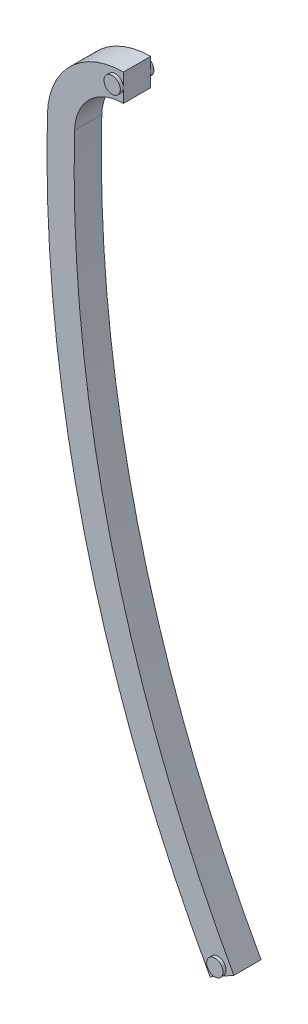
ISO-10303-21;
HEADER;
FILE_DESCRIPTION(('STEP AP214'),'2;1');
FILE_NAME('part.step','',(''),(''),'','','');
FILE_SCHEMA(('AUTOMOTIVE_DESIGN { 1 0 10303 214 1 1 1 1 }'));
ENDSEC;
DATA;
#1=APPLICATION_CONTEXT('core data for automotive mechanical design processes');
#2=APPLICATION_PROTOCOL_DEFINITION('international standard','automotive_design',2000,#1);
#3=PRODUCT_CONTEXT('',#1,'mechanical');
#4=PRODUCT('Part','Part','',(#3));
#5=PRODUCT_RELATED_PRODUCT_CATEGORY('part','',(#4));
#6=PRODUCT_DEFINITION_FORMATION('','',#4);
#7=PRODUCT_DEFINITION_CONTEXT('part definition',#1,'design');
#8=PRODUCT_DEFINITION('design','',#6,#7);
#9=PRODUCT_DEFINITION_SHAPE('','',#8);
#10=(LENGTH_UNIT() NAMED_UNIT(*) SI_UNIT(.MILLI.,.METRE.));
#11=(NAMED_UNIT(*) PLANE_ANGLE_UNIT() SI_UNIT($,.RADIAN.));
#12=(NAMED_UNIT(*) SI_UNIT($,.STERADIAN.) SOLID_ANGLE_UNIT());
#13=UNCERTAINTY_MEASURE_WITH_UNIT(LENGTH_MEASURE(1.E-05),#10,'distance_accuracy_value','');
#14=(GEOMETRIC_REPRESENTATION_CONTEXT(3) GLOBAL_UNCERTAINTY_ASSIGNED_CONTEXT((#13)) GLOBAL_UNIT_ASSIGNED_CONTEXT((#10,
#11,#12)) REPRESENTATION_CONTEXT('',''));
#15=CARTESIAN_POINT('',(0.,0.,0.));
#16=DIRECTION('',(0.,0.,1.));
#17=DIRECTION('',(1.,0.,0.));
#18=AXIS2_PLACEMENT_3D('',#15,#16,#17);
#19=CARTESIAN_POINT('',(-143.459415834383,3.81000110990592,3.175));
#20=DIRECTION('',(0.,0.,-1.));
#21=DIRECTION('',(-1.,0.,0.));
#22=AXIS2_PLACEMENT_3D('',#19,#20,#21);
#23=CYLINDRICAL_SURFACE('',#22,8.89);
#24=CARTESIAN_POINT('',(-143.459415834383,3.81000110990592,0.));
#25=DIRECTION('',(0.,0.,1.));
#26=DIRECTION('',(1.,0.,0.));
#27=AXIS2_PLACEMENT_3D('',#24,#25,#26);
#28=CIRCLE('',#27,8.89);
#29=CARTESIAN_POINT('',(-152.346282302,4.0460188777762,0.));
#30=VERTEX_POINT('',#29);
#31=CARTESIAN_POINT('',(-143.459415834383,12.7000011099059,0.));
#32=VERTEX_POINT('',#31);
#33=EDGE_CURVE('E119',#30,#32,#28,.F.);
#34=ORIENTED_EDGE('',*,*,#33,.F.);
#35=DIRECTION('',(0.,0.,-1.));
#36=VECTOR('',#35,1.);
#37=CARTESIAN_POINT('',(-152.346282302,4.0460188777762,3.175));
#38=LINE('',#37,#36);
#39=CARTESIAN_POINT('',(-152.346282302,4.0460188777762,3.175));
#40=VERTEX_POINT('',#39);
#41=EDGE_CURVE('E142',#40,#30,#38,.T.);
#42=ORIENTED_EDGE('',*,*,#41,.F.);
#43=CARTESIAN_POINT('',(-143.459415834383,3.81000110990592,3.175));
#44=DIRECTION('',(0.,0.,1.));
#45=DIRECTION('',(1.,0.,0.));
#46=AXIS2_PLACEMENT_3D('',#43,#44,#45);
#47=CIRCLE('',#46,8.89);
#48=CARTESIAN_POINT('',(-143.459415834383,12.7000011099059,3.175));
#49=VERTEX_POINT('',#48);
#50=EDGE_CURVE('E129',#40,#49,#47,.F.);
#51=ORIENTED_EDGE('',*,*,#50,.T.);
#52=DIRECTION('',(0.,0.,-1.));
#53=VECTOR('',#52,1.);
#54=CARTESIAN_POINT('',(-143.459415834383,12.7000011099059,3.175));
#55=LINE('',#54,#53);
#56=EDGE_CURVE('E130',#49,#32,#55,.T.);
#57=ORIENTED_EDGE('',*,*,#56,.T.);
#58=EDGE_LOOP('',(#34,#42,#51,#57));
#59=FACE_BOUND('',#58,.T.);
#60=ADVANCED_FACE('F40',(#59),#23,.T.);
#61=CARTESIAN_POINT('',(0.,0.,3.175));
#62=DIRECTION('',(0.,0.,-1.));
#63=DIRECTION('',(-1.,0.,0.));
#64=AXIS2_PLACEMENT_3D('',#61,#62,#63);
#65=CYLINDRICAL_SURFACE('',#64,152.4);
#66=CARTESIAN_POINT('',(0.,0.,0.));
#67=DIRECTION('',(0.,0.,1.));
#68=DIRECTION('',(1.,0.,0.));
#69=AXIS2_PLACEMENT_3D('',#66,#67,#68);
#70=CIRCLE('',#69,152.4);
#71=CARTESIAN_POINT('',(-133.350000582623,-73.7803316922238,0.));
#72=VERTEX_POINT('',#71);
#73=EDGE_CURVE('E118',#30,#72,#70,.T.);
#74=ORIENTED_EDGE('',*,*,#73,.T.);
#75=DIRECTION('',(0.,0.,-1.));
#76=VECTOR('',#75,1.);
#77=CARTESIAN_POINT('',(-133.350000582623,-73.7803316922238,3.175));
#78=LINE('',#77,#76);
#79=CARTESIAN_POINT('',(-133.350000582623,-73.7803316922238,3.175));
#80=VERTEX_POINT('',#79);
#81=EDGE_CURVE('E115',#80,#72,#78,.T.);
#82=ORIENTED_EDGE('',*,*,#81,.F.);
#83=CARTESIAN_POINT('',(0.,0.,3.175));
#84=DIRECTION('',(0.,0.,1.));
#85=DIRECTION('',(1.,0.,0.));
#86=AXIS2_PLACEMENT_3D('',#83,#84,#85);
#87=CIRCLE('',#86,152.4);
#88=EDGE_CURVE('E161',#40,#80,#87,.T.);
#89=ORIENTED_EDGE('',*,*,#88,.F.);
#90=ORIENTED_EDGE('',*,*,#41,.T.);
#91=EDGE_LOOP('',(#74,#82,#89,#90));
#92=FACE_BOUND('',#91,.T.);
#93=ADVANCED_FACE('F211',(#92),#65,.T.);
#94=CARTESIAN_POINT('',(2.41867981326341E-13,-4.3715031785612E-13,3.175));
#95=DIRECTION('',(0.484122911366295,-0.875000003822984,0.));
#96=DIRECTION('',(0.875000003822984,0.484122911366295,0.));
#97=AXIS2_PLACEMENT_3D('',#94,#95,#96);
#98=PLANE('',#97);
#99=DIRECTION('',(-0.875000003822984,-0.484122911366295,0.));
#100=VECTOR('',#99,1.);
#101=CARTESIAN_POINT('',(2.41867981326341E-13,-4.3715031785612E-13,0.));
#102=LINE('',#101,#100);
#103=CARTESIAN_POINT('',(-131.960938076554,-73.0117865704298,0.));
#104=VERTEX_POINT('',#103);
#105=EDGE_CURVE('E110',#104,#72,#102,.T.);
#106=ORIENTED_EDGE('',*,*,#105,.F.);
#107=CARTESIAN_POINT('',(-130.571875570485,-72.2432414486358,0.));
#108=VERTEX_POINT('',#107);
#109=EDGE_CURVE('E103',#108,#104,#102,.T.);
#110=ORIENTED_EDGE('',*,*,#109,.F.);
#111=DIRECTION('',(0.,0.,-1.));
#112=VECTOR('',#111,1.);
#113=CARTESIAN_POINT('',(-130.571875570485,-72.2432414486358,3.175));
#114=LINE('',#113,#112);
#115=CARTESIAN_POINT('',(-130.571875570485,-72.2432414486358,3.175));
#116=VERTEX_POINT('',#115);
#117=EDGE_CURVE('E139',#116,#108,#114,.T.);
#118=ORIENTED_EDGE('',*,*,#117,.F.);
#119=DIRECTION('',(-0.875000003822984,-0.484122911366295,0.));
#120=VECTOR('',#119,1.);
#121=CARTESIAN_POINT('',(2.41867981326341E-13,-4.3715031785612E-13,3.175));
#122=LINE('',#121,#120);
#123=CARTESIAN_POINT('',(-131.960938076554,-73.0117865704298,3.175));
#124=VERTEX_POINT('',#123);
#125=EDGE_CURVE('E168',#116,#124,#122,.T.);
#126=ORIENTED_EDGE('',*,*,#125,.T.);
#127=EDGE_CURVE('E163',#124,#80,#122,.T.);
#128=ORIENTED_EDGE('',*,*,#127,.T.);
#129=ORIENTED_EDGE('',*,*,#81,.T.);
#130=EDGE_LOOP('',(#106,#110,#118,#126,#128,#129));
#131=FACE_BOUND('',#130,.T.);
#132=ADVANCED_FACE('F113',(#131),#98,.T.);
#133=CARTESIAN_POINT('',(0.,0.,3.175));
#134=DIRECTION('',(0.,0.,-1.));
#135=DIRECTION('',(-1.,0.,0.));
#136=AXIS2_PLACEMENT_3D('',#133,#134,#135);
#137=CYLINDRICAL_SURFACE('',#136,149.225);
#138=CARTESIAN_POINT('',(0.,0.,0.));
#139=DIRECTION('',(0.,0.,1.));
#140=DIRECTION('',(1.,0.,0.));
#141=AXIS2_PLACEMENT_3D('',#138,#139,#140);
#142=CIRCLE('',#141,149.225);
#143=CARTESIAN_POINT('',(-149.172401420708,3.96172681782252,0.));
#144=VERTEX_POINT('',#143);
#145=EDGE_CURVE('E108',#144,#108,#142,.T.);
#146=ORIENTED_EDGE('',*,*,#145,.F.);
#147=DIRECTION('',(0.,0.,-1.));
#148=VECTOR('',#147,1.);
#149=CARTESIAN_POINT('',(-149.172401420708,3.96172681782252,3.175));
#150=LINE('',#149,#148);
#151=CARTESIAN_POINT('',(-149.172401420708,3.96172681782252,3.175));
#152=VERTEX_POINT('',#151);
#153=EDGE_CURVE('E137',#152,#144,#150,.T.);
#154=ORIENTED_EDGE('',*,*,#153,.F.);
#155=CARTESIAN_POINT('',(0.,0.,3.175));
#156=DIRECTION('',(0.,0.,1.));
#157=DIRECTION('',(1.,0.,0.));
#158=AXIS2_PLACEMENT_3D('',#155,#156,#157);
#159=CIRCLE('',#158,149.225);
#160=EDGE_CURVE('E171',#152,#116,#159,.T.);
#161=ORIENTED_EDGE('',*,*,#160,.T.);
#162=ORIENTED_EDGE('',*,*,#117,.T.);
#163=EDGE_LOOP('',(#146,#154,#161,#162));
#164=FACE_BOUND('',#163,.T.);
#165=ADVANCED_FACE('F219',(#164),#137,.F.);
#166=CARTESIAN_POINT('',(-143.459415834383,3.81000110990592,3.175));
#167=DIRECTION('',(0.,0.,-1.));
#168=DIRECTION('',(-1.,0.,0.));
#169=AXIS2_PLACEMENT_3D('',#166,#167,#168);
#170=CYLINDRICAL_SURFACE('',#169,5.71499999999999);
#171=CARTESIAN_POINT('',(-143.459415834383,3.81000110990592,0.));
#172=DIRECTION('',(0.,0.,1.));
#173=DIRECTION('',(1.,0.,0.));
#174=AXIS2_PLACEMENT_3D('',#171,#172,#173);
#175=CIRCLE('',#174,5.71499999999999);
#176=CARTESIAN_POINT('',(-143.459415834383,9.52500110990591,0.));
#177=VERTEX_POINT('',#176);
#178=EDGE_CURVE('E124',#144,#177,#175,.F.);
#179=ORIENTED_EDGE('',*,*,#178,.T.);
#180=DIRECTION('',(0.,0.,-1.));
#181=VECTOR('',#180,1.);
#182=CARTESIAN_POINT('',(-143.459415834383,9.52500110990591,3.175));
#183=LINE('',#182,#181);
#184=CARTESIAN_POINT('',(-143.459415834383,9.52500110990591,3.175));
#185=VERTEX_POINT('',#184);
#186=EDGE_CURVE('E133',#185,#177,#183,.T.);
#187=ORIENTED_EDGE('',*,*,#186,.F.);
#188=CARTESIAN_POINT('',(-143.459415834383,3.81000110990592,3.175));
#189=DIRECTION('',(0.,0.,1.));
#190=DIRECTION('',(1.,0.,0.));
#191=AXIS2_PLACEMENT_3D('',#188,#189,#190);
#192=CIRCLE('',#191,5.71499999999999);
#193=EDGE_CURVE('E174',#152,#185,#192,.F.);
#194=ORIENTED_EDGE('',*,*,#193,.F.);
#195=ORIENTED_EDGE('',*,*,#153,.T.);
#196=EDGE_LOOP('',(#179,#187,#194,#195));
#197=FACE_BOUND('',#196,.T.);
#198=ADVANCED_FACE('F224',(#197),#170,.F.);
#199=CARTESIAN_POINT('',(-143.459415834383,-1.2541098154221E-12,3.175));
#200=DIRECTION('',(-1.,0.,0.));
#201=DIRECTION('',(0.,-1.,0.));
#202=AXIS2_PLACEMENT_3D('',#199,#200,#201);
#203=PLANE('',#202);
#204=DIRECTION('',(0.,1.,0.));
#205=VECTOR('',#204,1.);
#206=CARTESIAN_POINT('',(-143.459415834383,-1.2541098154221E-12,3.175));
#207=LINE('',#206,#205);
#208=CARTESIAN_POINT('',(-143.459415834383,11.1125011099059,3.175));
#209=VERTEX_POINT('',#208);
#210=EDGE_CURVE('E176',#209,#49,#207,.T.);
#211=ORIENTED_EDGE('',*,*,#210,.F.);
#212=EDGE_CURVE('E134',#185,#209,#207,.T.);
#213=ORIENTED_EDGE('',*,*,#212,.F.);
#214=ORIENTED_EDGE('',*,*,#186,.T.);
#215=DIRECTION('',(0.,1.,0.));
#216=VECTOR('',#215,1.);
#217=CARTESIAN_POINT('',(-143.459415834383,-1.2541098154221E-12,0.));
#218=LINE('',#217,#216);
#219=CARTESIAN_POINT('',(-143.459415834383,11.1125011099059,0.));
#220=VERTEX_POINT('',#219);
#221=EDGE_CURVE('E127',#177,#220,#218,.T.);
#222=ORIENTED_EDGE('',*,*,#221,.T.);
#223=EDGE_CURVE('E126',#220,#32,#218,.T.);
#224=ORIENTED_EDGE('',*,*,#223,.T.);
#225=ORIENTED_EDGE('',*,*,#56,.F.);
#226=EDGE_LOOP('',(#211,#213,#214,#222,#224,#225));
#227=FACE_BOUND('',#226,.T.);
#228=ADVANCED_FACE('F154',(#227),#203,.F.);
#229=CARTESIAN_POINT('',(0.,0.,3.175));
#230=DIRECTION('',(0.,0.,1.));
#231=DIRECTION('',(1.,0.,0.));
#232=AXIS2_PLACEMENT_3D('',#229,#230,#231);
#233=PLANE('',#232);
#234=ORIENTED_EDGE('',*,*,#127,.F.);
#235=CARTESIAN_POINT('',(-132.42206514963,-72.1783490667884,3.175));
#236=DIRECTION('',(0.,0.,1.));
#237=DIRECTION('',(1.,0.,0.));
#238=AXIS2_PLACEMENT_3D('',#235,#236,#237);
#239=CIRCLE('',#238,0.952499999999996);
#240=EDGE_CURVE('E52',#124,#124,#239,.F.);
#241=ORIENTED_EDGE('',*,*,#240,.T.);
#242=ORIENTED_EDGE('',*,*,#125,.F.);
#243=ORIENTED_EDGE('',*,*,#160,.F.);
#244=ORIENTED_EDGE('',*,*,#193,.T.);
#245=ORIENTED_EDGE('',*,*,#212,.T.);
#246=CARTESIAN_POINT('',(-144.411915834383,11.1125011099059,3.175));
#247=DIRECTION('',(0.,0.,1.));
#248=DIRECTION('',(1.,0.,0.));
#249=AXIS2_PLACEMENT_3D('',#246,#247,#248);
#250=CIRCLE('',#249,0.952499999999996);
#251=EDGE_CURVE('E57',#209,#209,#250,.F.);
#252=ORIENTED_EDGE('',*,*,#251,.T.);
#253=ORIENTED_EDGE('',*,*,#210,.T.);
#254=ORIENTED_EDGE('',*,*,#50,.F.);
#255=ORIENTED_EDGE('',*,*,#88,.T.);
#256=EDGE_LOOP('',(#234,#241,#242,#243,#244,#245,#252,#253,#254,#255));
#257=FACE_BOUND('',#256,.T.);
#258=ADVANCED_FACE('F231',(#257),#233,.T.);
#259=CARTESIAN_POINT('',(0.,0.,0.));
#260=DIRECTION('',(0.,0.,1.));
#261=DIRECTION('',(1.,0.,0.));
#262=AXIS2_PLACEMENT_3D('',#259,#260,#261);
#263=PLANE('',#262);
#264=ORIENTED_EDGE('',*,*,#109,.T.);
#265=CARTESIAN_POINT('',(-132.42206514963,-72.1783490667884,0.));
#266=DIRECTION('',(0.,0.,1.));
#267=DIRECTION('',(1.,0.,0.));
#268=AXIS2_PLACEMENT_3D('',#265,#266,#267);
#269=CIRCLE('',#268,0.952499999999996);
#270=EDGE_CURVE('E11',#104,#104,#269,.F.);
#271=ORIENTED_EDGE('',*,*,#270,.F.);
#272=ORIENTED_EDGE('',*,*,#105,.T.);
#273=ORIENTED_EDGE('',*,*,#73,.F.);
#274=ORIENTED_EDGE('',*,*,#33,.T.);
#275=ORIENTED_EDGE('',*,*,#223,.F.);
#276=CARTESIAN_POINT('',(-144.411915834383,11.1125011099059,0.));
#277=DIRECTION('',(0.,0.,1.));
#278=DIRECTION('',(1.,0.,0.));
#279=AXIS2_PLACEMENT_3D('',#276,#277,#278);
#280=CIRCLE('',#279,0.952499999999996);
#281=EDGE_CURVE('E47',#220,#220,#280,.F.);
#282=ORIENTED_EDGE('',*,*,#281,.F.);
#283=ORIENTED_EDGE('',*,*,#221,.F.);
#284=ORIENTED_EDGE('',*,*,#178,.F.);
#285=ORIENTED_EDGE('',*,*,#145,.T.);
#286=EDGE_LOOP('',(#264,#271,#272,#273,#274,#275,#282,#283,#284,#285));
#287=FACE_BOUND('',#286,.T.);
#288=ADVANCED_FACE('F105',(#287),#263,.F.);
#289=CARTESIAN_POINT('',(-144.411915834383,11.1125011099059,-0.375));
#290=DIRECTION('',(0.,0.,-1.));
#291=DIRECTION('',(-1.,0.,0.));
#292=AXIS2_PLACEMENT_3D('',#289,#290,#291);
#293=PLANE('',#292);
#294=CARTESIAN_POINT('',(-144.411915834383,11.1125011099059,-0.375));
#295=DIRECTION('',(0.,0.,-1.));
#296=DIRECTION('',(-1.,0.,0.));
#297=AXIS2_PLACEMENT_3D('',#294,#295,#296);
#298=CIRCLE('',#297,0.952499999999996);
#299=CARTESIAN_POINT('',(-145.364415834383,11.1125011099059,-0.375));
#300=VERTEX_POINT('',#299);
#301=EDGE_CURVE('E178',#300,#300,#298,.T.);
#302=ORIENTED_EDGE('',*,*,#301,.T.);
#303=EDGE_LOOP('',(#302));
#304=FACE_BOUND('',#303,.T.);
#305=ADVANCED_FACE('F234',(#304),#293,.T.);
#306=CARTESIAN_POINT('',(-144.411915834383,11.1125011099059,-0.375));
#307=DIRECTION('',(0.,0.,1.));
#308=DIRECTION('',(1.,0.,0.));
#309=AXIS2_PLACEMENT_3D('',#306,#307,#308);
#310=CYLINDRICAL_SURFACE('',#309,0.952499999999996);
#311=ORIENTED_EDGE('',*,*,#301,.F.);
#312=EDGE_LOOP('',(#311));
#313=FACE_BOUND('',#312,.T.);
#314=ORIENTED_EDGE('',*,*,#281,.T.);
#315=EDGE_LOOP('',(#314));
#316=FACE_BOUND('',#315,.T.);
#317=ADVANCED_FACE('F146',(#313,#316),#310,.T.);
#318=ORIENTED_EDGE('',*,*,#251,.F.);
#319=EDGE_LOOP('',(#318));
#320=FACE_BOUND('',#319,.T.);
#321=CARTESIAN_POINT('',(-144.411915834383,11.1125011099059,3.55));
#322=DIRECTION('',(0.,0.,-1.));
#323=DIRECTION('',(-1.,0.,0.));
#324=AXIS2_PLACEMENT_3D('',#321,#322,#323);
#325=CIRCLE('',#324,0.952499999999996);
#326=CARTESIAN_POINT('',(-145.364415834383,11.1125011099059,3.55));
#327=VERTEX_POINT('',#326);
#328=EDGE_CURVE('E180',#327,#327,#325,.T.);
#329=ORIENTED_EDGE('',*,*,#328,.T.);
#330=EDGE_LOOP('',(#329));
#331=FACE_BOUND('',#330,.T.);
#332=ADVANCED_FACE('F237',(#320,#331),#310,.T.);
#333=CARTESIAN_POINT('',(-144.411915834383,11.1125011099059,3.55));
#334=DIRECTION('',(0.,0.,-1.));
#335=DIRECTION('',(-1.,0.,0.));
#336=AXIS2_PLACEMENT_3D('',#333,#334,#335);
#337=PLANE('',#336);
#338=ORIENTED_EDGE('',*,*,#328,.F.);
#339=EDGE_LOOP('',(#338));
#340=FACE_BOUND('',#339,.T.);
#341=ADVANCED_FACE('F206',(#340),#337,.F.);
#342=CARTESIAN_POINT('',(-132.42206514963,-72.1783490667884,-0.375));
#343=DIRECTION('',(0.,0.,-1.));
#344=DIRECTION('',(-1.,0.,0.));
#345=AXIS2_PLACEMENT_3D('',#342,#343,#344);
#346=PLANE('',#345);
#347=CARTESIAN_POINT('',(-132.42206514963,-72.1783490667884,-0.375));
#348=DIRECTION('',(0.,0.,-1.));
#349=DIRECTION('',(-1.,0.,0.));
#350=AXIS2_PLACEMENT_3D('',#347,#348,#349);
#351=CIRCLE('',#350,0.952499999999996);
#352=CARTESIAN_POINT('',(-133.37456514963,-72.1783490667884,-0.375));
#353=VERTEX_POINT('',#352);
#354=EDGE_CURVE('E187',#353,#353,#351,.T.);
#355=ORIENTED_EDGE('',*,*,#354,.T.);
#356=EDGE_LOOP('',(#355));
#357=FACE_BOUND('',#356,.T.);
#358=ADVANCED_FACE('F194',(#357),#346,.T.);
#359=CARTESIAN_POINT('',(-132.42206514963,-72.1783490667884,-0.375));
#360=DIRECTION('',(0.,0.,1.));
#361=DIRECTION('',(1.,0.,0.));
#362=AXIS2_PLACEMENT_3D('',#359,#360,#361);
#363=CYLINDRICAL_SURFACE('',#362,0.952499999999996);
#364=ORIENTED_EDGE('',*,*,#354,.F.);
#365=EDGE_LOOP('',(#364));
#366=FACE_BOUND('',#365,.T.);
#367=ORIENTED_EDGE('',*,*,#270,.T.);
#368=EDGE_LOOP('',(#367));
#369=FACE_BOUND('',#368,.T.);
#370=ADVANCED_FACE('F196',(#366,#369),#363,.T.);
#371=ORIENTED_EDGE('',*,*,#240,.F.);
#372=EDGE_LOOP('',(#371));
#373=FACE_BOUND('',#372,.T.);
#374=CARTESIAN_POINT('',(-132.42206514963,-72.1783490667884,3.55));
#375=DIRECTION('',(0.,0.,-1.));
#376=DIRECTION('',(-1.,0.,0.));
#377=AXIS2_PLACEMENT_3D('',#374,#375,#376);
#378=CIRCLE('',#377,0.952499999999996);
#379=CARTESIAN_POINT('',(-133.37456514963,-72.1783490667884,3.55));
#380=VERTEX_POINT('',#379);
#381=EDGE_CURVE('E188',#380,#380,#378,.T.);
#382=ORIENTED_EDGE('',*,*,#381,.T.);
#383=EDGE_LOOP('',(#382));
#384=FACE_BOUND('',#383,.T.);
#385=ADVANCED_FACE('F199',(#373,#384),#363,.T.);
#386=CARTESIAN_POINT('',(-132.42206514963,-72.1783490667884,3.55));
#387=DIRECTION('',(0.,0.,-1.));
#388=DIRECTION('',(-1.,0.,0.));
#389=AXIS2_PLACEMENT_3D('',#386,#387,#388);
#390=PLANE('',#389);
#391=ORIENTED_EDGE('',*,*,#381,.F.);
#392=EDGE_LOOP('',(#391));
#393=FACE_BOUND('',#392,.T.);
#394=ADVANCED_FACE('F205',(#393),#390,.F.);
#395=CLOSED_SHELL('',(#60,#93,#132,#165,#198,#228,#258,#288,#305,#317,#332,#341,#358,#370,#385,#394));
#396=MANIFOLD_SOLID_BREP('B2',#395);
#397=ADVANCED_BREP_SHAPE_REPRESENTATION('',(#18,#396),#14);
#398=SHAPE_DEFINITION_REPRESENTATION(#9,#397);
ENDSEC;
END-ISO-10303-21;
